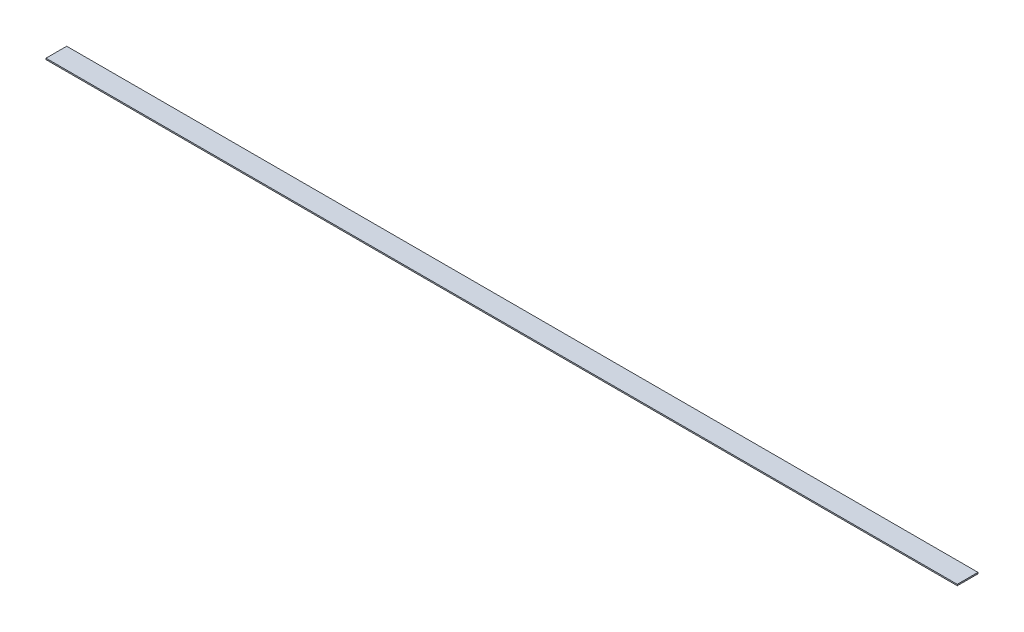
ISO-10303-21;
HEADER;
FILE_DESCRIPTION(('STEP AP214'),'2;1');
FILE_NAME('part.step','',(''),(''),'','','');
FILE_SCHEMA(('AUTOMOTIVE_DESIGN { 1 0 10303 214 1 1 1 1 }'));
ENDSEC;
DATA;
#1=APPLICATION_CONTEXT('core data for automotive mechanical design processes');
#2=APPLICATION_PROTOCOL_DEFINITION('international standard','automotive_design',2000,#1);
#3=PRODUCT_CONTEXT('',#1,'mechanical');
#4=PRODUCT('Part','Part','',(#3));
#5=PRODUCT_RELATED_PRODUCT_CATEGORY('part','',(#4));
#6=PRODUCT_DEFINITION_FORMATION('','',#4);
#7=PRODUCT_DEFINITION_CONTEXT('part definition',#1,'design');
#8=PRODUCT_DEFINITION('design','',#6,#7);
#9=PRODUCT_DEFINITION_SHAPE('','',#8);
#10=(LENGTH_UNIT() NAMED_UNIT(*) SI_UNIT(.MILLI.,.METRE.));
#11=(NAMED_UNIT(*) PLANE_ANGLE_UNIT() SI_UNIT($,.RADIAN.));
#12=(NAMED_UNIT(*) SI_UNIT($,.STERADIAN.) SOLID_ANGLE_UNIT());
#13=UNCERTAINTY_MEASURE_WITH_UNIT(LENGTH_MEASURE(1.E-05),#10,'distance_accuracy_value','');
#14=(GEOMETRIC_REPRESENTATION_CONTEXT(3) GLOBAL_UNCERTAINTY_ASSIGNED_CONTEXT((#13)) GLOBAL_UNIT_ASSIGNED_CONTEXT((#10,
#11,#12)) REPRESENTATION_CONTEXT('',''));
#15=CARTESIAN_POINT('',(0.,0.,0.));
#16=DIRECTION('',(0.,0.,1.));
#17=DIRECTION('',(1.,0.,0.));
#18=AXIS2_PLACEMENT_3D('',#15,#16,#17);
#19=CARTESIAN_POINT('',(-1117.6,3.175,25.4000000000001));
#20=DIRECTION('',(1.,0.,0.));
#21=DIRECTION('',(0.,0.,-1.));
#22=AXIS2_PLACEMENT_3D('',#19,#20,#21);
#23=PLANE('',#22);
#24=DIRECTION('',(0.,0.,1.));
#25=VECTOR('',#24,1.);
#26=CARTESIAN_POINT('',(-1117.6,0.,25.4000000000001));
#27=LINE('',#26,#25);
#28=CARTESIAN_POINT('',(-1117.6,0.,-25.3999999999999));
#29=VERTEX_POINT('',#28);
#30=CARTESIAN_POINT('',(-1117.6,0.,25.4000000000001));
#31=VERTEX_POINT('',#30);
#32=EDGE_CURVE('E95',#29,#31,#27,.T.);
#33=ORIENTED_EDGE('',*,*,#32,.T.);
#34=DIRECTION('',(0.,-1.,0.));
#35=VECTOR('',#34,1.);
#36=CARTESIAN_POINT('',(-1117.6,3.175,25.4000000000001));
#37=LINE('',#36,#35);
#38=CARTESIAN_POINT('',(-1117.6,3.175,25.4000000000001));
#39=VERTEX_POINT('',#38);
#40=EDGE_CURVE('E11',#39,#31,#37,.T.);
#41=ORIENTED_EDGE('',*,*,#40,.F.);
#42=DIRECTION('',(0.,0.,1.));
#43=VECTOR('',#42,1.);
#44=CARTESIAN_POINT('',(-1117.6,3.175,25.4000000000001));
#45=LINE('',#44,#43);
#46=CARTESIAN_POINT('',(-1117.6,3.175,-25.3999999999999));
#47=VERTEX_POINT('',#46);
#48=EDGE_CURVE('E83',#47,#39,#45,.T.);
#49=ORIENTED_EDGE('',*,*,#48,.F.);
#50=DIRECTION('',(0.,-1.,0.));
#51=VECTOR('',#50,1.);
#52=CARTESIAN_POINT('',(-1117.6,3.175,-25.3999999999999));
#53=LINE('',#52,#51);
#54=EDGE_CURVE('E91',#47,#29,#53,.T.);
#55=ORIENTED_EDGE('',*,*,#54,.T.);
#56=EDGE_LOOP('',(#33,#41,#49,#55));
#57=FACE_BOUND('',#56,.T.);
#58=ADVANCED_FACE('F32',(#57),#23,.F.);
#59=CARTESIAN_POINT('',(1117.6,3.175,25.3999999999999));
#60=DIRECTION('',(0.,0.,-1.));
#61=DIRECTION('',(-1.,0.,0.));
#62=AXIS2_PLACEMENT_3D('',#59,#60,#61);
#63=PLANE('',#62);
#64=DIRECTION('',(1.,0.,0.));
#65=VECTOR('',#64,1.);
#66=CARTESIAN_POINT('',(1117.6,0.,25.3999999999999));
#67=LINE('',#66,#65);
#68=CARTESIAN_POINT('',(1117.6,0.,25.3999999999999));
#69=VERTEX_POINT('',#68);
#70=EDGE_CURVE('E87',#31,#69,#67,.T.);
#71=ORIENTED_EDGE('',*,*,#70,.T.);
#72=DIRECTION('',(0.,-1.,0.));
#73=VECTOR('',#72,1.);
#74=CARTESIAN_POINT('',(1117.6,3.175,25.3999999999999));
#75=LINE('',#74,#73);
#76=CARTESIAN_POINT('',(1117.6,3.175,25.3999999999999));
#77=VERTEX_POINT('',#76);
#78=EDGE_CURVE('E40',#77,#69,#75,.T.);
#79=ORIENTED_EDGE('',*,*,#78,.F.);
#80=DIRECTION('',(1.,0.,0.));
#81=VECTOR('',#80,1.);
#82=CARTESIAN_POINT('',(1117.6,3.175,25.3999999999999));
#83=LINE('',#82,#81);
#84=EDGE_CURVE('E78',#39,#77,#83,.T.);
#85=ORIENTED_EDGE('',*,*,#84,.F.);
#86=ORIENTED_EDGE('',*,*,#40,.T.);
#87=EDGE_LOOP('',(#71,#79,#85,#86));
#88=FACE_BOUND('',#87,.T.);
#89=ADVANCED_FACE('F86',(#88),#63,.F.);
#90=CARTESIAN_POINT('',(1117.6,3.175,25.3999999999999));
#91=DIRECTION('',(-1.,0.,0.));
#92=DIRECTION('',(0.,0.,1.));
#93=AXIS2_PLACEMENT_3D('',#90,#91,#92);
#94=PLANE('',#93);
#95=DIRECTION('',(0.,0.,-1.));
#96=VECTOR('',#95,1.);
#97=CARTESIAN_POINT('',(1117.6,0.,25.3999999999999));
#98=LINE('',#97,#96);
#99=CARTESIAN_POINT('',(1117.6,0.,-25.4000000000001));
#100=VERTEX_POINT('',#99);
#101=EDGE_CURVE('E65',#69,#100,#98,.T.);
#102=ORIENTED_EDGE('',*,*,#101,.T.);
#103=DIRECTION('',(0.,-1.,0.));
#104=VECTOR('',#103,1.);
#105=CARTESIAN_POINT('',(1117.6,3.175,-25.4000000000001));
#106=LINE('',#105,#104);
#107=CARTESIAN_POINT('',(1117.6,3.175,-25.4000000000001));
#108=VERTEX_POINT('',#107);
#109=EDGE_CURVE('E88',#108,#100,#106,.T.);
#110=ORIENTED_EDGE('',*,*,#109,.F.);
#111=DIRECTION('',(0.,0.,-1.));
#112=VECTOR('',#111,1.);
#113=CARTESIAN_POINT('',(1117.6,3.175,25.3999999999999));
#114=LINE('',#113,#112);
#115=EDGE_CURVE('E81',#77,#108,#114,.T.);
#116=ORIENTED_EDGE('',*,*,#115,.F.);
#117=ORIENTED_EDGE('',*,*,#78,.T.);
#118=EDGE_LOOP('',(#102,#110,#116,#117));
#119=FACE_BOUND('',#118,.T.);
#120=ADVANCED_FACE('F89',(#119),#94,.F.);
#121=CARTESIAN_POINT('',(1117.6,3.175,-25.4000000000001));
#122=DIRECTION('',(0.,0.,1.));
#123=DIRECTION('',(1.,0.,0.));
#124=AXIS2_PLACEMENT_3D('',#121,#122,#123);
#125=PLANE('',#124);
#126=DIRECTION('',(-1.,0.,0.));
#127=VECTOR('',#126,1.);
#128=CARTESIAN_POINT('',(1117.6,0.,-25.4000000000001));
#129=LINE('',#128,#127);
#130=EDGE_CURVE('E71',#100,#29,#129,.T.);
#131=ORIENTED_EDGE('',*,*,#130,.T.);
#132=ORIENTED_EDGE('',*,*,#54,.F.);
#133=DIRECTION('',(-1.,0.,0.));
#134=VECTOR('',#133,1.);
#135=CARTESIAN_POINT('',(1117.6,3.175,-25.4000000000001));
#136=LINE('',#135,#134);
#137=EDGE_CURVE('E48',#108,#47,#136,.T.);
#138=ORIENTED_EDGE('',*,*,#137,.F.);
#139=ORIENTED_EDGE('',*,*,#109,.T.);
#140=EDGE_LOOP('',(#131,#132,#138,#139));
#141=FACE_BOUND('',#140,.T.);
#142=ADVANCED_FACE('F102',(#141),#125,.F.);
#143=CARTESIAN_POINT('',(0.,3.175,0.));
#144=DIRECTION('',(0.,1.,0.));
#145=DIRECTION('',(0.,0.,1.));
#146=AXIS2_PLACEMENT_3D('',#143,#144,#145);
#147=PLANE('',#146);
#148=ORIENTED_EDGE('',*,*,#48,.T.);
#149=ORIENTED_EDGE('',*,*,#84,.T.);
#150=ORIENTED_EDGE('',*,*,#115,.T.);
#151=ORIENTED_EDGE('',*,*,#137,.T.);
#152=EDGE_LOOP('',(#148,#149,#150,#151));
#153=FACE_BOUND('',#152,.T.);
#154=ADVANCED_FACE('F79',(#153),#147,.T.);
#155=CARTESIAN_POINT('',(0.,0.,0.));
#156=DIRECTION('',(0.,1.,0.));
#157=DIRECTION('',(0.,0.,1.));
#158=AXIS2_PLACEMENT_3D('',#155,#156,#157);
#159=PLANE('',#158);
#160=ORIENTED_EDGE('',*,*,#32,.F.);
#161=ORIENTED_EDGE('',*,*,#130,.F.);
#162=ORIENTED_EDGE('',*,*,#101,.F.);
#163=ORIENTED_EDGE('',*,*,#70,.F.);
#164=EDGE_LOOP('',(#160,#161,#162,#163));
#165=FACE_BOUND('',#164,.T.);
#166=ADVANCED_FACE('F105',(#165),#159,.F.);
#167=CLOSED_SHELL('',(#58,#89,#120,#142,#154,#166));
#168=MANIFOLD_SOLID_BREP('B2',#167);
#169=ADVANCED_BREP_SHAPE_REPRESENTATION('',(#18,#168),#14);
#170=SHAPE_DEFINITION_REPRESENTATION(#9,#169);
ENDSEC;
END-ISO-10303-21;
